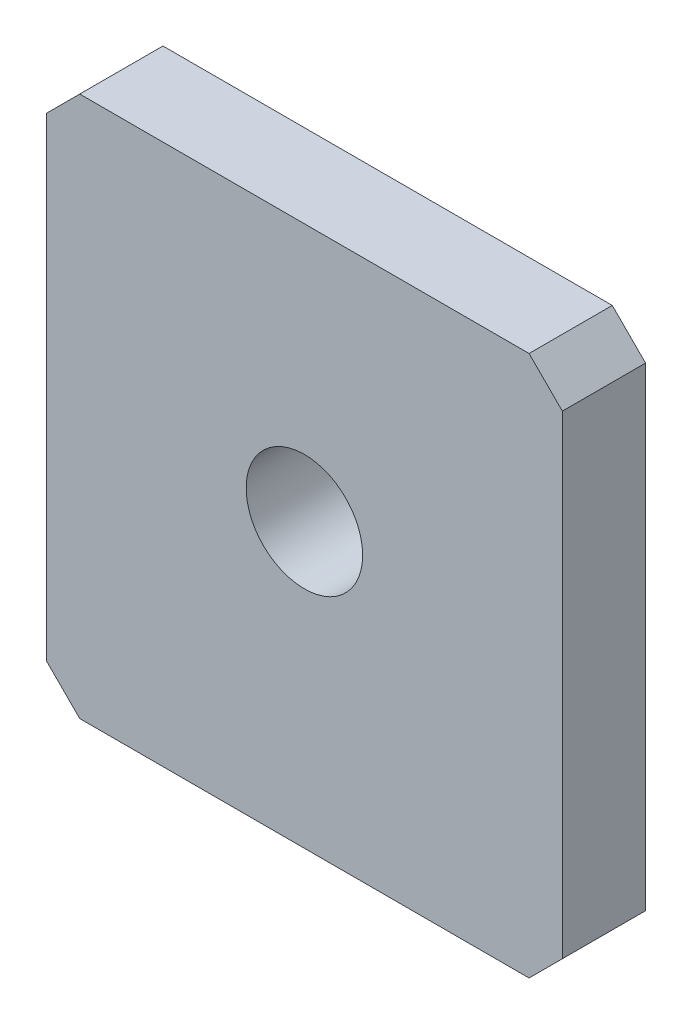
ISO-10303-21;
HEADER;
FILE_DESCRIPTION(('STEP AP214'),'2;1');
FILE_NAME('part.step','',(''),(''),'','','');
FILE_SCHEMA(('AUTOMOTIVE_DESIGN { 1 0 10303 214 1 1 1 1 }'));
ENDSEC;
DATA;
#1=APPLICATION_CONTEXT('core data for automotive mechanical design processes');
#2=APPLICATION_PROTOCOL_DEFINITION('international standard','automotive_design',2000,#1);
#3=PRODUCT_CONTEXT('',#1,'mechanical');
#4=PRODUCT('Part','Part','',(#3));
#5=PRODUCT_RELATED_PRODUCT_CATEGORY('part','',(#4));
#6=PRODUCT_DEFINITION_FORMATION('','',#4);
#7=PRODUCT_DEFINITION_CONTEXT('part definition',#1,'design');
#8=PRODUCT_DEFINITION('design','',#6,#7);
#9=PRODUCT_DEFINITION_SHAPE('','',#8);
#10=(LENGTH_UNIT() NAMED_UNIT(*) SI_UNIT(.MILLI.,.METRE.));
#11=(NAMED_UNIT(*) PLANE_ANGLE_UNIT() SI_UNIT($,.RADIAN.));
#12=(NAMED_UNIT(*) SI_UNIT($,.STERADIAN.) SOLID_ANGLE_UNIT());
#13=UNCERTAINTY_MEASURE_WITH_UNIT(LENGTH_MEASURE(1.E-05),#10,'distance_accuracy_value','');
#14=(GEOMETRIC_REPRESENTATION_CONTEXT(3) GLOBAL_UNCERTAINTY_ASSIGNED_CONTEXT((#13)) GLOBAL_UNIT_ASSIGNED_CONTEXT((#10,
#11,#12)) REPRESENTATION_CONTEXT('',''));
#15=CARTESIAN_POINT('',(0.,0.,0.));
#16=DIRECTION('',(0.,0.,1.));
#17=DIRECTION('',(1.,0.,0.));
#18=AXIS2_PLACEMENT_3D('',#15,#16,#17);
#19=CARTESIAN_POINT('',(-1.351,0.55,-7.149));
#20=DIRECTION('',(0.,1.,0.));
#21=DIRECTION('',(1.,0.,0.));
#22=AXIS2_PLACEMENT_3D('',#19,#20,#21);
#23=PLANE('',#22);
#24=DIRECTION('',(-1.,0.,0.));
#25=VECTOR('',#24,1.);
#26=CARTESIAN_POINT('',(0.,0.55,-7.15));
#27=LINE('',#26,#25);
#28=CARTESIAN_POINT('',(1.35,0.55,-7.15));
#29=VERTEX_POINT('',#28);
#30=CARTESIAN_POINT('',(-1.35,0.55,-7.15));
#31=VERTEX_POINT('',#30);
#32=EDGE_CURVE('E106',#29,#31,#27,.T.);
#33=ORIENTED_EDGE('',*,*,#32,.F.);
#34=DIRECTION('',(0.,0.,1.));
#35=VECTOR('',#34,1.);
#36=CARTESIAN_POINT('',(1.35,0.549999999999999,-7.4));
#37=LINE('',#36,#35);
#38=CARTESIAN_POINT('',(1.35,0.55,-7.65));
#39=VERTEX_POINT('',#38);
#40=EDGE_CURVE('E81',#39,#29,#37,.T.);
#41=ORIENTED_EDGE('',*,*,#40,.F.);
#42=DIRECTION('',(1.,0.,0.));
#43=VECTOR('',#42,1.);
#44=CARTESIAN_POINT('',(0.,0.55,-7.65));
#45=LINE('',#44,#43);
#46=CARTESIAN_POINT('',(-1.35,0.55,-7.65));
#47=VERTEX_POINT('',#46);
#48=EDGE_CURVE('E102',#47,#39,#45,.T.);
#49=ORIENTED_EDGE('',*,*,#48,.F.);
#50=DIRECTION('',(0.,0.,-1.));
#51=VECTOR('',#50,1.);
#52=CARTESIAN_POINT('',(-1.35,0.549999999999999,-7.4));
#53=LINE('',#52,#51);
#54=EDGE_CURVE('E115',#31,#47,#53,.T.);
#55=ORIENTED_EDGE('',*,*,#54,.F.);
#56=EDGE_LOOP('',(#33,#41,#49,#55));
#57=FACE_BOUND('',#56,.T.);
#58=ADVANCED_FACE('F17',(#57),#23,.T.);
#59=CARTESIAN_POINT('',(-1.34929289321881,0.550707106781187,-7.149));
#60=DIRECTION('',(-0.707106781186537,0.707106781186558,0.));
#61=DIRECTION('',(0.,0.,-1.));
#62=AXIS2_PLACEMENT_3D('',#59,#60,#61);
#63=PLANE('',#62);
#64=ORIENTED_EDGE('',*,*,#54,.T.);
#65=DIRECTION('',(0.707106781186548,0.707106781186547,0.));
#66=VECTOR('',#65,1.);
#67=CARTESIAN_POINT('',(-1.55,0.35,-7.65));
#68=LINE('',#67,#66);
#69=CARTESIAN_POINT('',(-1.55,0.35,-7.65));
#70=VERTEX_POINT('',#69);
#71=EDGE_CURVE('E105',#70,#47,#68,.T.);
#72=ORIENTED_EDGE('',*,*,#71,.F.);
#73=DIRECTION('',(0.,0.,-1.));
#74=VECTOR('',#73,1.);
#75=CARTESIAN_POINT('',(-1.55,0.35,-7.4));
#76=LINE('',#75,#74);
#77=CARTESIAN_POINT('',(-1.55,0.35,-7.15));
#78=VERTEX_POINT('',#77);
#79=EDGE_CURVE('E129',#78,#70,#76,.T.);
#80=ORIENTED_EDGE('',*,*,#79,.F.);
#81=DIRECTION('',(-0.707106781186548,-0.707106781186547,0.));
#82=VECTOR('',#81,1.);
#83=CARTESIAN_POINT('',(-1.35,0.55,-7.15));
#84=LINE('',#83,#82);
#85=EDGE_CURVE('E109',#31,#78,#84,.T.);
#86=ORIENTED_EDGE('',*,*,#85,.F.);
#87=EDGE_LOOP('',(#64,#72,#80,#86));
#88=FACE_BOUND('',#87,.T.);
#89=ADVANCED_FACE('F167',(#88),#63,.T.);
#90=CARTESIAN_POINT('',(-1.55,-2.501,-7.149));
#91=DIRECTION('',(-1.,0.,0.));
#92=DIRECTION('',(0.,1.,0.));
#93=AXIS2_PLACEMENT_3D('',#90,#91,#92);
#94=PLANE('',#93);
#95=DIRECTION('',(0.,-1.,0.));
#96=VECTOR('',#95,1.);
#97=CARTESIAN_POINT('',(-1.55,-1.075,-7.15));
#98=LINE('',#97,#96);
#99=CARTESIAN_POINT('',(-1.55,-2.5,-7.15));
#100=VERTEX_POINT('',#99);
#101=EDGE_CURVE('E133',#78,#100,#98,.T.);
#102=ORIENTED_EDGE('',*,*,#101,.F.);
#103=ORIENTED_EDGE('',*,*,#79,.T.);
#104=DIRECTION('',(0.,1.,0.));
#105=VECTOR('',#104,1.);
#106=CARTESIAN_POINT('',(-1.55,-1.075,-7.65));
#107=LINE('',#106,#105);
#108=CARTESIAN_POINT('',(-1.55,-2.5,-7.65));
#109=VERTEX_POINT('',#108);
#110=EDGE_CURVE('E111',#109,#70,#107,.T.);
#111=ORIENTED_EDGE('',*,*,#110,.F.);
#112=DIRECTION('',(0.,0.,-1.));
#113=VECTOR('',#112,1.);
#114=CARTESIAN_POINT('',(-1.55,-2.5,-7.4));
#115=LINE('',#114,#113);
#116=EDGE_CURVE('E127',#100,#109,#115,.T.);
#117=ORIENTED_EDGE('',*,*,#116,.F.);
#118=EDGE_LOOP('',(#102,#103,#111,#117));
#119=FACE_BOUND('',#118,.T.);
#120=ADVANCED_FACE('F170',(#119),#94,.T.);
#121=CARTESIAN_POINT('',(-1.34929289321881,-2.70070710678119,-7.651));
#122=DIRECTION('',(-0.70710678118655,-0.707106781186545,0.));
#123=DIRECTION('',(0.,0.,1.));
#124=AXIS2_PLACEMENT_3D('',#121,#122,#123);
#125=PLANE('',#124);
#126=ORIENTED_EDGE('',*,*,#116,.T.);
#127=DIRECTION('',(-0.707106781186548,0.707106781186548,0.));
#128=VECTOR('',#127,1.);
#129=CARTESIAN_POINT('',(-1.35,-2.7,-7.65));
#130=LINE('',#129,#128);
#131=CARTESIAN_POINT('',(-1.35,-2.7,-7.65));
#132=VERTEX_POINT('',#131);
#133=EDGE_CURVE('E125',#132,#109,#130,.T.);
#134=ORIENTED_EDGE('',*,*,#133,.F.);
#135=DIRECTION('',(0.,0.,-1.));
#136=VECTOR('',#135,1.);
#137=CARTESIAN_POINT('',(-1.35,-2.7,-7.4));
#138=LINE('',#137,#136);
#139=CARTESIAN_POINT('',(-1.35,-2.7,-7.15));
#140=VERTEX_POINT('',#139);
#141=EDGE_CURVE('E121',#140,#132,#138,.T.);
#142=ORIENTED_EDGE('',*,*,#141,.F.);
#143=DIRECTION('',(0.707106781186548,-0.707106781186548,0.));
#144=VECTOR('',#143,1.);
#145=CARTESIAN_POINT('',(-1.55,-2.5,-7.15));
#146=LINE('',#145,#144);
#147=EDGE_CURVE('E136',#100,#140,#146,.T.);
#148=ORIENTED_EDGE('',*,*,#147,.F.);
#149=EDGE_LOOP('',(#126,#134,#142,#148));
#150=FACE_BOUND('',#149,.T.);
#151=ADVANCED_FACE('F160',(#150),#125,.T.);
#152=CARTESIAN_POINT('',(1.351,-2.7,-7.149));
#153=DIRECTION('',(0.,-1.,0.));
#154=DIRECTION('',(-1.,0.,0.));
#155=AXIS2_PLACEMENT_3D('',#152,#153,#154);
#156=PLANE('',#155);
#157=DIRECTION('',(1.,0.,0.));
#158=VECTOR('',#157,1.);
#159=CARTESIAN_POINT('',(0.,-2.7,-7.15));
#160=LINE('',#159,#158);
#161=CARTESIAN_POINT('',(1.35,-2.7,-7.15));
#162=VERTEX_POINT('',#161);
#163=EDGE_CURVE('E137',#140,#162,#160,.T.);
#164=ORIENTED_EDGE('',*,*,#163,.F.);
#165=ORIENTED_EDGE('',*,*,#141,.T.);
#166=DIRECTION('',(-1.,0.,0.));
#167=VECTOR('',#166,1.);
#168=CARTESIAN_POINT('',(0.,-2.7,-7.65));
#169=LINE('',#168,#167);
#170=CARTESIAN_POINT('',(1.35,-2.7,-7.65));
#171=VERTEX_POINT('',#170);
#172=EDGE_CURVE('E122',#171,#132,#169,.T.);
#173=ORIENTED_EDGE('',*,*,#172,.F.);
#174=DIRECTION('',(0.,0.,-1.));
#175=VECTOR('',#174,1.);
#176=CARTESIAN_POINT('',(1.35,-2.7,-7.4));
#177=LINE('',#176,#175);
#178=EDGE_CURVE('E119',#162,#171,#177,.T.);
#179=ORIENTED_EDGE('',*,*,#178,.F.);
#180=EDGE_LOOP('',(#164,#165,#173,#179));
#181=FACE_BOUND('',#180,.T.);
#182=ADVANCED_FACE('F156',(#181),#156,.T.);
#183=CARTESIAN_POINT('',(1.34929289321881,-2.70070710678119,-7.149));
#184=DIRECTION('',(0.70710678118655,-0.707106781186545,0.));
#185=DIRECTION('',(0.,0.,-1.));
#186=AXIS2_PLACEMENT_3D('',#183,#184,#185);
#187=PLANE('',#186);
#188=ORIENTED_EDGE('',*,*,#178,.T.);
#189=DIRECTION('',(-0.707106781186548,-0.707106781186548,0.));
#190=VECTOR('',#189,1.);
#191=CARTESIAN_POINT('',(1.55,-2.5,-7.65));
#192=LINE('',#191,#190);
#193=CARTESIAN_POINT('',(1.55,-2.5,-7.65));
#194=VERTEX_POINT('',#193);
#195=EDGE_CURVE('E98',#194,#171,#192,.T.);
#196=ORIENTED_EDGE('',*,*,#195,.F.);
#197=DIRECTION('',(0.,0.,-1.));
#198=VECTOR('',#197,1.);
#199=CARTESIAN_POINT('',(1.55,-2.5,-7.4));
#200=LINE('',#199,#198);
#201=CARTESIAN_POINT('',(1.55,-2.5,-7.15));
#202=VERTEX_POINT('',#201);
#203=EDGE_CURVE('E94',#202,#194,#200,.T.);
#204=ORIENTED_EDGE('',*,*,#203,.F.);
#205=DIRECTION('',(0.707106781186548,0.707106781186548,0.));
#206=VECTOR('',#205,1.);
#207=CARTESIAN_POINT('',(1.35,-2.7,-7.15));
#208=LINE('',#207,#206);
#209=EDGE_CURVE('E131',#162,#202,#208,.T.);
#210=ORIENTED_EDGE('',*,*,#209,.F.);
#211=EDGE_LOOP('',(#188,#196,#204,#210));
#212=FACE_BOUND('',#211,.T.);
#213=ADVANCED_FACE('F152',(#212),#187,.T.);
#214=CARTESIAN_POINT('',(1.55,0.351,-7.149));
#215=DIRECTION('',(1.,0.,0.));
#216=DIRECTION('',(0.,-1.,0.));
#217=AXIS2_PLACEMENT_3D('',#214,#215,#216);
#218=PLANE('',#217);
#219=DIRECTION('',(0.,-1.,0.));
#220=VECTOR('',#219,1.);
#221=CARTESIAN_POINT('',(1.55,-1.075,-7.65));
#222=LINE('',#221,#220);
#223=CARTESIAN_POINT('',(1.55,0.350000000000001,-7.65));
#224=VERTEX_POINT('',#223);
#225=EDGE_CURVE('E92',#224,#194,#222,.T.);
#226=ORIENTED_EDGE('',*,*,#225,.F.);
#227=DIRECTION('',(0.,0.,-1.));
#228=VECTOR('',#227,1.);
#229=CARTESIAN_POINT('',(1.55,0.350000000000002,-7.4));
#230=LINE('',#229,#228);
#231=CARTESIAN_POINT('',(1.55,0.350000000000001,-7.15));
#232=VERTEX_POINT('',#231);
#233=EDGE_CURVE('E36',#232,#224,#230,.T.);
#234=ORIENTED_EDGE('',*,*,#233,.F.);
#235=DIRECTION('',(0.,1.,0.));
#236=VECTOR('',#235,1.);
#237=CARTESIAN_POINT('',(1.55,-1.075,-7.15));
#238=LINE('',#237,#236);
#239=EDGE_CURVE('E130',#202,#232,#238,.T.);
#240=ORIENTED_EDGE('',*,*,#239,.F.);
#241=ORIENTED_EDGE('',*,*,#203,.T.);
#242=EDGE_LOOP('',(#226,#234,#240,#241));
#243=FACE_BOUND('',#242,.T.);
#244=ADVANCED_FACE('F93',(#243),#218,.T.);
#245=CARTESIAN_POINT('',(1.34929289321881,0.550707106781187,-7.651));
#246=DIRECTION('',(0.707106781186537,0.707106781186558,0.));
#247=DIRECTION('',(0.,0.,1.));
#248=AXIS2_PLACEMENT_3D('',#245,#246,#247);
#249=PLANE('',#248);
#250=ORIENTED_EDGE('',*,*,#233,.T.);
#251=DIRECTION('',(0.707106781186548,-0.707106781186547,0.));
#252=VECTOR('',#251,1.);
#253=CARTESIAN_POINT('',(1.35,0.55,-7.65));
#254=LINE('',#253,#252);
#255=EDGE_CURVE('E21',#39,#224,#254,.T.);
#256=ORIENTED_EDGE('',*,*,#255,.F.);
#257=ORIENTED_EDGE('',*,*,#40,.T.);
#258=DIRECTION('',(-0.707106781186548,0.707106781186547,0.));
#259=VECTOR('',#258,1.);
#260=CARTESIAN_POINT('',(1.55,0.35,-7.15));
#261=LINE('',#260,#259);
#262=EDGE_CURVE('E88',#232,#29,#261,.T.);
#263=ORIENTED_EDGE('',*,*,#262,.F.);
#264=EDGE_LOOP('',(#250,#256,#257,#263));
#265=FACE_BOUND('',#264,.T.);
#266=ADVANCED_FACE('F84',(#265),#249,.T.);
#267=CARTESIAN_POINT('',(1.551,-2.701,-7.65));
#268=DIRECTION('',(0.,0.,-1.));
#269=DIRECTION('',(-1.,0.,0.));
#270=AXIS2_PLACEMENT_3D('',#267,#268,#269);
#271=PLANE('',#270);
#272=CARTESIAN_POINT('',(0.,-1.,-7.65));
#273=DIRECTION('',(0.,0.,1.));
#274=DIRECTION('',(1.,0.,0.));
#275=AXIS2_PLACEMENT_3D('',#272,#273,#274);
#276=CIRCLE('',#275,0.35);
#277=CARTESIAN_POINT('',(0.35,-1.,-7.65));
#278=VERTEX_POINT('',#277);
#279=EDGE_CURVE('E27',#278,#278,#276,.F.);
#280=ORIENTED_EDGE('',*,*,#279,.F.);
#281=EDGE_LOOP('',(#280));
#282=FACE_BOUND('',#281,.T.);
#283=ORIENTED_EDGE('',*,*,#71,.T.);
#284=ORIENTED_EDGE('',*,*,#48,.T.);
#285=ORIENTED_EDGE('',*,*,#255,.T.);
#286=ORIENTED_EDGE('',*,*,#225,.T.);
#287=ORIENTED_EDGE('',*,*,#195,.T.);
#288=ORIENTED_EDGE('',*,*,#172,.T.);
#289=ORIENTED_EDGE('',*,*,#133,.T.);
#290=ORIENTED_EDGE('',*,*,#110,.T.);
#291=EDGE_LOOP('',(#283,#284,#285,#286,#287,#288,#289,#290));
#292=FACE_BOUND('',#291,.T.);
#293=ADVANCED_FACE('F101',(#282,#292),#271,.T.);
#294=CARTESIAN_POINT('',(-1.551,-2.701,-7.15));
#295=DIRECTION('',(0.,0.,1.));
#296=DIRECTION('',(1.,0.,0.));
#297=AXIS2_PLACEMENT_3D('',#294,#295,#296);
#298=PLANE('',#297);
#299=CARTESIAN_POINT('',(0.,-1.,-7.15));
#300=DIRECTION('',(0.,0.,1.));
#301=DIRECTION('',(1.,0.,0.));
#302=AXIS2_PLACEMENT_3D('',#299,#300,#301);
#303=CIRCLE('',#302,0.35);
#304=CARTESIAN_POINT('',(0.35,-1.,-7.15));
#305=VERTEX_POINT('',#304);
#306=EDGE_CURVE('E11',#305,#305,#303,.T.);
#307=ORIENTED_EDGE('',*,*,#306,.F.);
#308=EDGE_LOOP('',(#307));
#309=FACE_BOUND('',#308,.T.);
#310=ORIENTED_EDGE('',*,*,#239,.T.);
#311=ORIENTED_EDGE('',*,*,#262,.T.);
#312=ORIENTED_EDGE('',*,*,#32,.T.);
#313=ORIENTED_EDGE('',*,*,#85,.T.);
#314=ORIENTED_EDGE('',*,*,#101,.T.);
#315=ORIENTED_EDGE('',*,*,#147,.T.);
#316=ORIENTED_EDGE('',*,*,#163,.T.);
#317=ORIENTED_EDGE('',*,*,#209,.T.);
#318=EDGE_LOOP('',(#310,#311,#312,#313,#314,#315,#316,#317));
#319=FACE_BOUND('',#318,.T.);
#320=ADVANCED_FACE('F169',(#309,#319),#298,.T.);
#321=CARTESIAN_POINT('',(0.,-1.,-7.65));
#322=DIRECTION('',(0.,0.,1.));
#323=DIRECTION('',(1.,0.,0.));
#324=AXIS2_PLACEMENT_3D('',#321,#322,#323);
#325=CYLINDRICAL_SURFACE('',#324,0.35);
#326=ORIENTED_EDGE('',*,*,#306,.T.);
#327=EDGE_LOOP('',(#326));
#328=FACE_BOUND('',#327,.T.);
#329=ORIENTED_EDGE('',*,*,#279,.T.);
#330=EDGE_LOOP('',(#329));
#331=FACE_BOUND('',#330,.T.);
#332=ADVANCED_FACE('F19',(#328,#331),#325,.F.);
#333=CLOSED_SHELL('',(#58,#89,#120,#151,#182,#213,#244,#266,#293,#320,#332));
#334=MANIFOLD_SOLID_BREP('B1',#333);
#335=ADVANCED_BREP_SHAPE_REPRESENTATION('',(#18,#334),#14);
#336=SHAPE_DEFINITION_REPRESENTATION(#9,#335);
ENDSEC;
END-ISO-10303-21;
